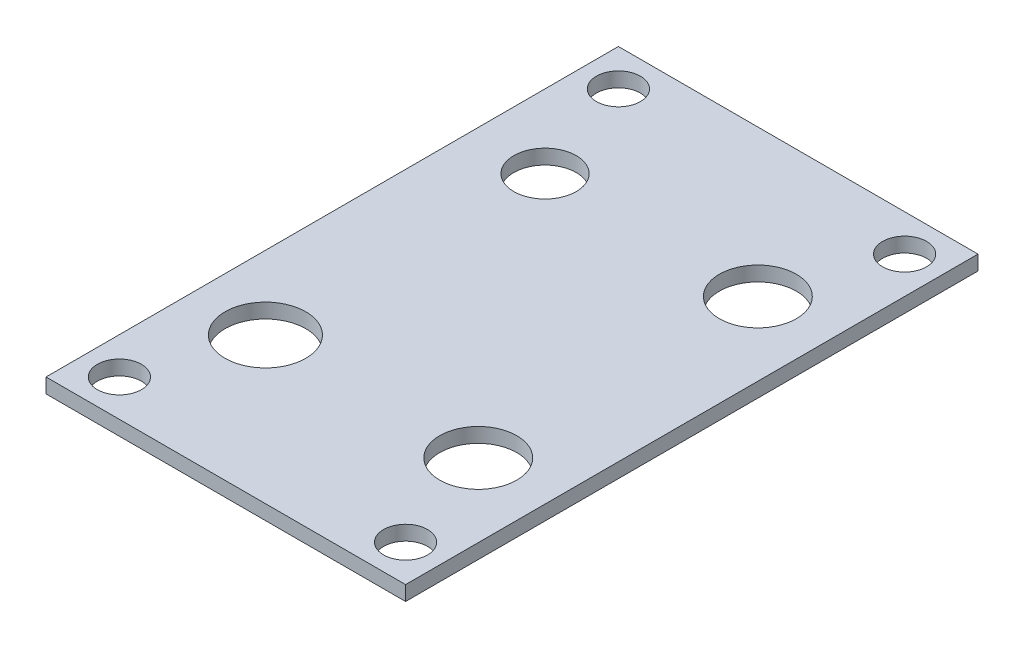
ISO-10303-21;
HEADER;
FILE_DESCRIPTION(('STEP AP214'),'2;1');
FILE_NAME('part.step','',(''),(''),'','','');
FILE_SCHEMA(('AUTOMOTIVE_DESIGN { 1 0 10303 214 1 1 1 1 }'));
ENDSEC;
DATA;
#1=APPLICATION_CONTEXT('core data for automotive mechanical design processes');
#2=APPLICATION_PROTOCOL_DEFINITION('international standard','automotive_design',2000,#1);
#3=PRODUCT_CONTEXT('',#1,'mechanical');
#4=PRODUCT('Part','Part','',(#3));
#5=PRODUCT_RELATED_PRODUCT_CATEGORY('part','',(#4));
#6=PRODUCT_DEFINITION_FORMATION('','',#4);
#7=PRODUCT_DEFINITION_CONTEXT('part definition',#1,'design');
#8=PRODUCT_DEFINITION('design','',#6,#7);
#9=PRODUCT_DEFINITION_SHAPE('','',#8);
#10=(LENGTH_UNIT() NAMED_UNIT(*) SI_UNIT(.MILLI.,.METRE.));
#11=(NAMED_UNIT(*) PLANE_ANGLE_UNIT() SI_UNIT($,.RADIAN.));
#12=(NAMED_UNIT(*) SI_UNIT($,.STERADIAN.) SOLID_ANGLE_UNIT());
#13=UNCERTAINTY_MEASURE_WITH_UNIT(LENGTH_MEASURE(1.E-05),#10,'distance_accuracy_value','');
#14=(GEOMETRIC_REPRESENTATION_CONTEXT(3) GLOBAL_UNCERTAINTY_ASSIGNED_CONTEXT((#13)) GLOBAL_UNIT_ASSIGNED_CONTEXT((#10,
#11,#12)) REPRESENTATION_CONTEXT('',''));
#15=CARTESIAN_POINT('',(0.,0.,0.));
#16=DIRECTION('',(0.,0.,1.));
#17=DIRECTION('',(1.,0.,0.));
#18=AXIS2_PLACEMENT_3D('',#15,#16,#17);
#19=CARTESIAN_POINT('',(0.,2.,0.));
#20=DIRECTION('',(0.,1.,0.));
#21=DIRECTION('',(0.,0.,1.));
#22=AXIS2_PLACEMENT_3D('',#19,#20,#21);
#23=PLANE('',#22);
#24=CARTESIAN_POINT('',(-19.5,2.,36.));
#25=DIRECTION('',(0.,1.,0.));
#26=DIRECTION('',(0.,0.,1.));
#27=AXIS2_PLACEMENT_3D('',#24,#25,#26);
#28=CIRCLE('',#27,3.);
#29=CARTESIAN_POINT('',(-19.5,2.,39.));
#30=VERTEX_POINT('',#29);
#31=EDGE_CURVE('E149',#30,#30,#28,.T.);
#32=ORIENTED_EDGE('',*,*,#31,.F.);
#33=EDGE_LOOP('',(#32));
#34=FACE_BOUND('',#33,.T.);
#35=CARTESIAN_POINT('',(19.5,2.,36.));
#36=DIRECTION('',(0.,1.,0.));
#37=DIRECTION('',(0.,0.,1.));
#38=AXIS2_PLACEMENT_3D('',#35,#36,#37);
#39=CIRCLE('',#38,3.);
#40=CARTESIAN_POINT('',(19.5,2.,39.));
#41=VERTEX_POINT('',#40);
#42=EDGE_CURVE('E99',#41,#41,#39,.T.);
#43=ORIENTED_EDGE('',*,*,#42,.F.);
#44=EDGE_LOOP('',(#43));
#45=FACE_BOUND('',#44,.T.);
#46=CARTESIAN_POINT('',(-19.5,2.,-32.));
#47=DIRECTION('',(0.,1.,0.));
#48=DIRECTION('',(0.,0.,1.));
#49=AXIS2_PLACEMENT_3D('',#46,#47,#48);
#50=CIRCLE('',#49,3.);
#51=CARTESIAN_POINT('',(-19.5,2.,-29.));
#52=VERTEX_POINT('',#51);
#53=EDGE_CURVE('E111',#52,#52,#50,.T.);
#54=ORIENTED_EDGE('',*,*,#53,.F.);
#55=EDGE_LOOP('',(#54));
#56=FACE_BOUND('',#55,.T.);
#57=CARTESIAN_POINT('',(-14.5,2.,-17.));
#58=DIRECTION('',(0.,1.,0.));
#59=DIRECTION('',(0.,0.,1.));
#60=AXIS2_PLACEMENT_3D('',#57,#58,#59);
#61=CIRCLE('',#60,4.25);
#62=CARTESIAN_POINT('',(-14.5,2.,-12.75));
#63=VERTEX_POINT('',#62);
#64=EDGE_CURVE('E123',#63,#63,#61,.T.);
#65=ORIENTED_EDGE('',*,*,#64,.F.);
#66=EDGE_LOOP('',(#65));
#67=FACE_BOUND('',#66,.T.);
#68=CARTESIAN_POINT('',(14.5,2.,21.1));
#69=DIRECTION('',(0.,1.,0.));
#70=DIRECTION('',(0.,0.,1.));
#71=AXIS2_PLACEMENT_3D('',#68,#69,#70);
#72=CIRCLE('',#71,5.25);
#73=CARTESIAN_POINT('',(14.5,2.,26.35));
#74=VERTEX_POINT('',#73);
#75=EDGE_CURVE('E135',#74,#74,#72,.T.);
#76=ORIENTED_EDGE('',*,*,#75,.F.);
#77=EDGE_LOOP('',(#76));
#78=FACE_BOUND('',#77,.T.);
#79=DIRECTION('',(0.,0.,-1.));
#80=VECTOR('',#79,1.);
#81=CARTESIAN_POINT('',(24.5,2.,-37.));
#82=LINE('',#81,#80);
#83=CARTESIAN_POINT('',(24.5,2.,41.));
#84=VERTEX_POINT('',#83);
#85=CARTESIAN_POINT('',(24.5,2.,-37.));
#86=VERTEX_POINT('',#85);
#87=EDGE_CURVE('E141',#84,#86,#82,.T.);
#88=ORIENTED_EDGE('',*,*,#87,.T.);
#89=DIRECTION('',(-1.,0.,0.));
#90=VECTOR('',#89,1.);
#91=CARTESIAN_POINT('',(-24.5,2.,-37.));
#92=LINE('',#91,#90);
#93=CARTESIAN_POINT('',(-24.5,2.,-37.));
#94=VERTEX_POINT('',#93);
#95=EDGE_CURVE('E52',#86,#94,#92,.T.);
#96=ORIENTED_EDGE('',*,*,#95,.T.);
#97=DIRECTION('',(0.,0.,1.));
#98=VECTOR('',#97,1.);
#99=CARTESIAN_POINT('',(-24.5,2.,-37.));
#100=LINE('',#99,#98);
#101=CARTESIAN_POINT('',(-24.5,2.,41.));
#102=VERTEX_POINT('',#101);
#103=EDGE_CURVE('E79',#94,#102,#100,.T.);
#104=ORIENTED_EDGE('',*,*,#103,.T.);
#105=DIRECTION('',(1.,0.,0.));
#106=VECTOR('',#105,1.);
#107=CARTESIAN_POINT('',(-24.5,2.,41.));
#108=LINE('',#107,#106);
#109=EDGE_CURVE('E82',#102,#84,#108,.T.);
#110=ORIENTED_EDGE('',*,*,#109,.T.);
#111=EDGE_LOOP('',(#88,#96,#104,#110));
#112=FACE_BOUND('',#111,.T.);
#113=CARTESIAN_POINT('',(-14.5,2.,21.1));
#114=DIRECTION('',(0.,1.,0.));
#115=DIRECTION('',(0.,0.,1.));
#116=AXIS2_PLACEMENT_3D('',#113,#114,#115);
#117=CIRCLE('',#116,5.5);
#118=CARTESIAN_POINT('',(-14.5,2.,26.6));
#119=VERTEX_POINT('',#118);
#120=EDGE_CURVE('E129',#119,#119,#117,.T.);
#121=ORIENTED_EDGE('',*,*,#120,.F.);
#122=EDGE_LOOP('',(#121));
#123=FACE_BOUND('',#122,.T.);
#124=CARTESIAN_POINT('',(14.5,2.,-17.));
#125=DIRECTION('',(0.,1.,0.));
#126=DIRECTION('',(0.,0.,1.));
#127=AXIS2_PLACEMENT_3D('',#124,#125,#126);
#128=CIRCLE('',#127,5.25);
#129=CARTESIAN_POINT('',(14.5,2.,-11.75));
#130=VERTEX_POINT('',#129);
#131=EDGE_CURVE('E117',#130,#130,#128,.T.);
#132=ORIENTED_EDGE('',*,*,#131,.F.);
#133=EDGE_LOOP('',(#132));
#134=FACE_BOUND('',#133,.T.);
#135=CARTESIAN_POINT('',(19.5,2.,-32.));
#136=DIRECTION('',(0.,1.,0.));
#137=DIRECTION('',(0.,0.,1.));
#138=AXIS2_PLACEMENT_3D('',#135,#136,#137);
#139=CIRCLE('',#138,3.);
#140=CARTESIAN_POINT('',(19.5,2.,-29.));
#141=VERTEX_POINT('',#140);
#142=EDGE_CURVE('E105',#141,#141,#139,.T.);
#143=ORIENTED_EDGE('',*,*,#142,.F.);
#144=EDGE_LOOP('',(#143));
#145=FACE_BOUND('',#144,.T.);
#146=ADVANCED_FACE('F33',(#34,#45,#56,#67,#78,#112,#123,#134,#145),#23,.T.);
#147=CARTESIAN_POINT('',(0.,0.,0.));
#148=DIRECTION('',(0.,1.,0.));
#149=DIRECTION('',(0.,0.,1.));
#150=AXIS2_PLACEMENT_3D('',#147,#148,#149);
#151=PLANE('',#150);
#152=CARTESIAN_POINT('',(-19.5,0.,36.));
#153=DIRECTION('',(0.,1.,0.));
#154=DIRECTION('',(0.,0.,1.));
#155=AXIS2_PLACEMENT_3D('',#152,#153,#154);
#156=CIRCLE('',#155,3.);
#157=CARTESIAN_POINT('',(-19.5,0.,39.));
#158=VERTEX_POINT('',#157);
#159=EDGE_CURVE('E37',#158,#158,#156,.T.);
#160=ORIENTED_EDGE('',*,*,#159,.T.);
#161=EDGE_LOOP('',(#160));
#162=FACE_BOUND('',#161,.T.);
#163=CARTESIAN_POINT('',(19.5,0.,36.));
#164=DIRECTION('',(0.,1.,0.));
#165=DIRECTION('',(0.,0.,1.));
#166=AXIS2_PLACEMENT_3D('',#163,#164,#165);
#167=CIRCLE('',#166,3.);
#168=CARTESIAN_POINT('',(19.5,0.,39.));
#169=VERTEX_POINT('',#168);
#170=EDGE_CURVE('E96',#169,#169,#167,.T.);
#171=ORIENTED_EDGE('',*,*,#170,.T.);
#172=EDGE_LOOP('',(#171));
#173=FACE_BOUND('',#172,.T.);
#174=DIRECTION('',(0.,0.,-1.));
#175=VECTOR('',#174,1.);
#176=CARTESIAN_POINT('',(24.5,0.,-37.));
#177=LINE('',#176,#175);
#178=CARTESIAN_POINT('',(24.5,0.,41.));
#179=VERTEX_POINT('',#178);
#180=CARTESIAN_POINT('',(24.5,0.,-37.));
#181=VERTEX_POINT('',#180);
#182=EDGE_CURVE('E138',#179,#181,#177,.T.);
#183=ORIENTED_EDGE('',*,*,#182,.F.);
#184=DIRECTION('',(-1.,0.,0.));
#185=VECTOR('',#184,1.);
#186=CARTESIAN_POINT('',(-24.5,0.,41.));
#187=LINE('',#186,#185);
#188=CARTESIAN_POINT('',(-24.5,0.,41.));
#189=VERTEX_POINT('',#188);
#190=EDGE_CURVE('E101',#179,#189,#187,.T.);
#191=ORIENTED_EDGE('',*,*,#190,.T.);
#192=DIRECTION('',(0.,0.,1.));
#193=VECTOR('',#192,1.);
#194=CARTESIAN_POINT('',(-24.5,0.,-37.));
#195=LINE('',#194,#193);
#196=CARTESIAN_POINT('',(-24.5,0.,-37.));
#197=VERTEX_POINT('',#196);
#198=EDGE_CURVE('E69',#197,#189,#195,.T.);
#199=ORIENTED_EDGE('',*,*,#198,.F.);
#200=DIRECTION('',(-1.,0.,0.));
#201=VECTOR('',#200,1.);
#202=CARTESIAN_POINT('',(-24.5,0.,-37.));
#203=LINE('',#202,#201);
#204=EDGE_CURVE('E63',#181,#197,#203,.T.);
#205=ORIENTED_EDGE('',*,*,#204,.F.);
#206=EDGE_LOOP('',(#183,#191,#199,#205));
#207=FACE_BOUND('',#206,.T.);
#208=CARTESIAN_POINT('',(14.5,0.,21.1));
#209=DIRECTION('',(0.,1.,0.));
#210=DIRECTION('',(0.,0.,1.));
#211=AXIS2_PLACEMENT_3D('',#208,#209,#210);
#212=CIRCLE('',#211,5.25);
#213=CARTESIAN_POINT('',(14.5,0.,26.35));
#214=VERTEX_POINT('',#213);
#215=EDGE_CURVE('E132',#214,#214,#212,.T.);
#216=ORIENTED_EDGE('',*,*,#215,.T.);
#217=EDGE_LOOP('',(#216));
#218=FACE_BOUND('',#217,.T.);
#219=CARTESIAN_POINT('',(-14.5,0.,21.1));
#220=DIRECTION('',(0.,1.,0.));
#221=DIRECTION('',(0.,0.,1.));
#222=AXIS2_PLACEMENT_3D('',#219,#220,#221);
#223=CIRCLE('',#222,5.5);
#224=CARTESIAN_POINT('',(-14.5,0.,26.6));
#225=VERTEX_POINT('',#224);
#226=EDGE_CURVE('E126',#225,#225,#223,.T.);
#227=ORIENTED_EDGE('',*,*,#226,.T.);
#228=EDGE_LOOP('',(#227));
#229=FACE_BOUND('',#228,.T.);
#230=CARTESIAN_POINT('',(-14.5,0.,-17.));
#231=DIRECTION('',(0.,1.,0.));
#232=DIRECTION('',(0.,0.,1.));
#233=AXIS2_PLACEMENT_3D('',#230,#231,#232);
#234=CIRCLE('',#233,4.25);
#235=CARTESIAN_POINT('',(-14.5,0.,-12.75));
#236=VERTEX_POINT('',#235);
#237=EDGE_CURVE('E120',#236,#236,#234,.T.);
#238=ORIENTED_EDGE('',*,*,#237,.T.);
#239=EDGE_LOOP('',(#238));
#240=FACE_BOUND('',#239,.T.);
#241=CARTESIAN_POINT('',(14.5,0.,-17.));
#242=DIRECTION('',(0.,1.,0.));
#243=DIRECTION('',(0.,0.,1.));
#244=AXIS2_PLACEMENT_3D('',#241,#242,#243);
#245=CIRCLE('',#244,5.25);
#246=CARTESIAN_POINT('',(14.5,0.,-11.75));
#247=VERTEX_POINT('',#246);
#248=EDGE_CURVE('E114',#247,#247,#245,.T.);
#249=ORIENTED_EDGE('',*,*,#248,.T.);
#250=EDGE_LOOP('',(#249));
#251=FACE_BOUND('',#250,.T.);
#252=CARTESIAN_POINT('',(-19.5,0.,-32.));
#253=DIRECTION('',(0.,1.,0.));
#254=DIRECTION('',(0.,0.,1.));
#255=AXIS2_PLACEMENT_3D('',#252,#253,#254);
#256=CIRCLE('',#255,3.);
#257=CARTESIAN_POINT('',(-19.5,0.,-29.));
#258=VERTEX_POINT('',#257);
#259=EDGE_CURVE('E108',#258,#258,#256,.T.);
#260=ORIENTED_EDGE('',*,*,#259,.T.);
#261=EDGE_LOOP('',(#260));
#262=FACE_BOUND('',#261,.T.);
#263=CARTESIAN_POINT('',(19.5,0.,-32.));
#264=DIRECTION('',(0.,1.,0.));
#265=DIRECTION('',(0.,0.,1.));
#266=AXIS2_PLACEMENT_3D('',#263,#264,#265);
#267=CIRCLE('',#266,3.);
#268=CARTESIAN_POINT('',(19.5,0.,-29.));
#269=VERTEX_POINT('',#268);
#270=EDGE_CURVE('E104',#269,#269,#267,.T.);
#271=ORIENTED_EDGE('',*,*,#270,.T.);
#272=EDGE_LOOP('',(#271));
#273=FACE_BOUND('',#272,.T.);
#274=ADVANCED_FACE('F163',(#162,#173,#207,#218,#229,#240,#251,#262,#273),#151,.F.);
#275=CARTESIAN_POINT('',(24.5,2.,-37.));
#276=DIRECTION('',(-1.,0.,0.));
#277=DIRECTION('',(0.,0.,1.));
#278=AXIS2_PLACEMENT_3D('',#275,#276,#277);
#279=PLANE('',#278);
#280=ORIENTED_EDGE('',*,*,#182,.T.);
#281=DIRECTION('',(0.,-1.,0.));
#282=VECTOR('',#281,1.);
#283=CARTESIAN_POINT('',(24.5,2.,-37.));
#284=LINE('',#283,#282);
#285=EDGE_CURVE('E11',#86,#181,#284,.T.);
#286=ORIENTED_EDGE('',*,*,#285,.F.);
#287=ORIENTED_EDGE('',*,*,#87,.F.);
#288=DIRECTION('',(0.,1.,0.));
#289=VECTOR('',#288,1.);
#290=CARTESIAN_POINT('',(24.5,-49.254441424099,41.));
#291=LINE('',#290,#289);
#292=EDGE_CURVE('E89',#179,#84,#291,.T.);
#293=ORIENTED_EDGE('',*,*,#292,.F.);
#294=EDGE_LOOP('',(#280,#286,#287,#293));
#295=FACE_BOUND('',#294,.T.);
#296=ADVANCED_FACE('F35',(#295),#279,.F.);
#297=CARTESIAN_POINT('',(-24.5,2.,-37.));
#298=DIRECTION('',(0.,0.,1.));
#299=DIRECTION('',(1.,0.,0.));
#300=AXIS2_PLACEMENT_3D('',#297,#298,#299);
#301=PLANE('',#300);
#302=ORIENTED_EDGE('',*,*,#204,.T.);
#303=DIRECTION('',(0.,-1.,0.));
#304=VECTOR('',#303,1.);
#305=CARTESIAN_POINT('',(-24.5,2.,-37.));
#306=LINE('',#305,#304);
#307=EDGE_CURVE('E43',#94,#197,#306,.T.);
#308=ORIENTED_EDGE('',*,*,#307,.F.);
#309=ORIENTED_EDGE('',*,*,#95,.F.);
#310=ORIENTED_EDGE('',*,*,#285,.T.);
#311=EDGE_LOOP('',(#302,#308,#309,#310));
#312=FACE_BOUND('',#311,.T.);
#313=ADVANCED_FACE('F219',(#312),#301,.F.);
#314=CARTESIAN_POINT('',(-24.5,2.,-37.));
#315=DIRECTION('',(1.,0.,0.));
#316=DIRECTION('',(0.,0.,-1.));
#317=AXIS2_PLACEMENT_3D('',#314,#315,#316);
#318=PLANE('',#317);
#319=ORIENTED_EDGE('',*,*,#198,.T.);
#320=DIRECTION('',(0.,1.,0.));
#321=VECTOR('',#320,1.);
#322=CARTESIAN_POINT('',(-24.5,-49.254441424099,41.));
#323=LINE('',#322,#321);
#324=EDGE_CURVE('E85',#189,#102,#323,.T.);
#325=ORIENTED_EDGE('',*,*,#324,.T.);
#326=ORIENTED_EDGE('',*,*,#103,.F.);
#327=ORIENTED_EDGE('',*,*,#307,.T.);
#328=EDGE_LOOP('',(#319,#325,#326,#327));
#329=FACE_BOUND('',#328,.T.);
#330=ADVANCED_FACE('F86',(#329),#318,.F.);
#331=CARTESIAN_POINT('',(14.5,2.,21.1));
#332=DIRECTION('',(0.,-1.,0.));
#333=DIRECTION('',(0.,0.,-1.));
#334=AXIS2_PLACEMENT_3D('',#331,#332,#333);
#335=CYLINDRICAL_SURFACE('',#334,5.25);
#336=ORIENTED_EDGE('',*,*,#75,.T.);
#337=EDGE_LOOP('',(#336));
#338=FACE_BOUND('',#337,.T.);
#339=ORIENTED_EDGE('',*,*,#215,.F.);
#340=EDGE_LOOP('',(#339));
#341=FACE_BOUND('',#340,.T.);
#342=ADVANCED_FACE('F172',(#338,#341),#335,.F.);
#343=CARTESIAN_POINT('',(-14.5,2.,21.1));
#344=DIRECTION('',(0.,-1.,0.));
#345=DIRECTION('',(0.,0.,-1.));
#346=AXIS2_PLACEMENT_3D('',#343,#344,#345);
#347=CYLINDRICAL_SURFACE('',#346,5.5);
#348=ORIENTED_EDGE('',*,*,#120,.T.);
#349=EDGE_LOOP('',(#348));
#350=FACE_BOUND('',#349,.T.);
#351=ORIENTED_EDGE('',*,*,#226,.F.);
#352=EDGE_LOOP('',(#351));
#353=FACE_BOUND('',#352,.T.);
#354=ADVANCED_FACE('F175',(#350,#353),#347,.F.);
#355=CARTESIAN_POINT('',(-14.5,2.,-17.));
#356=DIRECTION('',(0.,-1.,0.));
#357=DIRECTION('',(0.,0.,-1.));
#358=AXIS2_PLACEMENT_3D('',#355,#356,#357);
#359=CYLINDRICAL_SURFACE('',#358,4.25);
#360=ORIENTED_EDGE('',*,*,#64,.T.);
#361=EDGE_LOOP('',(#360));
#362=FACE_BOUND('',#361,.T.);
#363=ORIENTED_EDGE('',*,*,#237,.F.);
#364=EDGE_LOOP('',(#363));
#365=FACE_BOUND('',#364,.T.);
#366=ADVANCED_FACE('F210',(#362,#365),#359,.F.);
#367=CARTESIAN_POINT('',(14.5,2.,-17.));
#368=DIRECTION('',(0.,-1.,0.));
#369=DIRECTION('',(0.,0.,-1.));
#370=AXIS2_PLACEMENT_3D('',#367,#368,#369);
#371=CYLINDRICAL_SURFACE('',#370,5.25);
#372=ORIENTED_EDGE('',*,*,#131,.T.);
#373=EDGE_LOOP('',(#372));
#374=FACE_BOUND('',#373,.T.);
#375=ORIENTED_EDGE('',*,*,#248,.F.);
#376=EDGE_LOOP('',(#375));
#377=FACE_BOUND('',#376,.T.);
#378=ADVANCED_FACE('F203',(#374,#377),#371,.F.);
#379=CARTESIAN_POINT('',(-19.5,2.,-32.));
#380=DIRECTION('',(0.,-1.,0.));
#381=DIRECTION('',(0.,0.,-1.));
#382=AXIS2_PLACEMENT_3D('',#379,#380,#381);
#383=CYLINDRICAL_SURFACE('',#382,3.);
#384=ORIENTED_EDGE('',*,*,#53,.T.);
#385=EDGE_LOOP('',(#384));
#386=FACE_BOUND('',#385,.T.);
#387=ORIENTED_EDGE('',*,*,#259,.F.);
#388=EDGE_LOOP('',(#387));
#389=FACE_BOUND('',#388,.T.);
#390=ADVANCED_FACE('F195',(#386,#389),#383,.F.);
#391=CARTESIAN_POINT('',(19.5,2.,-32.));
#392=DIRECTION('',(0.,-1.,0.));
#393=DIRECTION('',(0.,0.,-1.));
#394=AXIS2_PLACEMENT_3D('',#391,#392,#393);
#395=CYLINDRICAL_SURFACE('',#394,3.);
#396=ORIENTED_EDGE('',*,*,#142,.T.);
#397=EDGE_LOOP('',(#396));
#398=FACE_BOUND('',#397,.T.);
#399=ORIENTED_EDGE('',*,*,#270,.F.);
#400=EDGE_LOOP('',(#399));
#401=FACE_BOUND('',#400,.T.);
#402=ADVANCED_FACE('F193',(#398,#401),#395,.F.);
#403=CARTESIAN_POINT('',(-24.5,-49.254441424099,41.));
#404=DIRECTION('',(0.,0.,1.));
#405=DIRECTION('',(1.,0.,0.));
#406=AXIS2_PLACEMENT_3D('',#403,#404,#405);
#407=PLANE('',#406);
#408=ORIENTED_EDGE('',*,*,#190,.F.);
#409=ORIENTED_EDGE('',*,*,#292,.T.);
#410=ORIENTED_EDGE('',*,*,#109,.F.);
#411=ORIENTED_EDGE('',*,*,#324,.F.);
#412=EDGE_LOOP('',(#408,#409,#410,#411));
#413=FACE_BOUND('',#412,.T.);
#414=ADVANCED_FACE('F92',(#413),#407,.T.);
#415=CARTESIAN_POINT('',(19.5,-8.,36.));
#416=DIRECTION('',(0.,1.,0.));
#417=DIRECTION('',(0.,0.,1.));
#418=AXIS2_PLACEMENT_3D('',#415,#416,#417);
#419=CYLINDRICAL_SURFACE('',#418,3.);
#420=ORIENTED_EDGE('',*,*,#42,.T.);
#421=EDGE_LOOP('',(#420));
#422=FACE_BOUND('',#421,.T.);
#423=ORIENTED_EDGE('',*,*,#170,.F.);
#424=EDGE_LOOP('',(#423));
#425=FACE_BOUND('',#424,.T.);
#426=ADVANCED_FACE('F158',(#422,#425),#419,.F.);
#427=CARTESIAN_POINT('',(-19.5,-8.,36.));
#428=DIRECTION('',(0.,1.,0.));
#429=DIRECTION('',(0.,0.,1.));
#430=AXIS2_PLACEMENT_3D('',#427,#428,#429);
#431=CYLINDRICAL_SURFACE('',#430,3.);
#432=ORIENTED_EDGE('',*,*,#31,.T.);
#433=EDGE_LOOP('',(#432));
#434=FACE_BOUND('',#433,.T.);
#435=ORIENTED_EDGE('',*,*,#159,.F.);
#436=EDGE_LOOP('',(#435));
#437=FACE_BOUND('',#436,.T.);
#438=ADVANCED_FACE('F312',(#434,#437),#431,.F.);
#439=CLOSED_SHELL('',(#146,#274,#296,#313,#330,#342,#354,#366,#378,#390,#402,#414,#426,#438));
#440=MANIFOLD_SOLID_BREP('B2',#439);
#441=ADVANCED_BREP_SHAPE_REPRESENTATION('',(#18,#440),#14);
#442=SHAPE_DEFINITION_REPRESENTATION(#9,#441);
ENDSEC;
END-ISO-10303-21;
